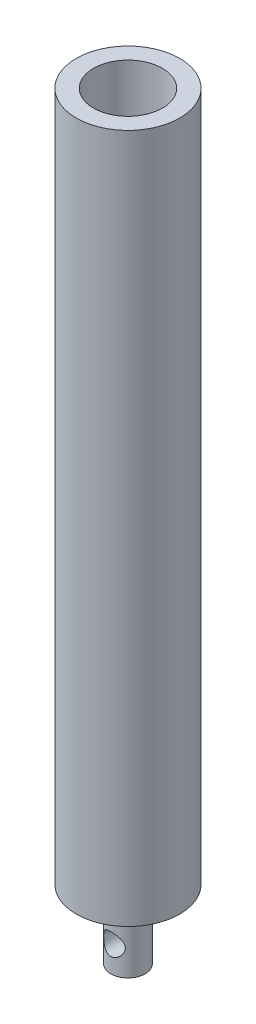
ISO-10303-21;
HEADER;
FILE_DESCRIPTION(('STEP AP214'),'2;1');
FILE_NAME('part.step','',(''),(''),'','','');
FILE_SCHEMA(('AUTOMOTIVE_DESIGN { 1 0 10303 214 1 1 1 1 }'));
ENDSEC;
DATA;
#1=APPLICATION_CONTEXT('core data for automotive mechanical design processes');
#2=APPLICATION_PROTOCOL_DEFINITION('international standard','automotive_design',2000,#1);
#3=PRODUCT_CONTEXT('',#1,'mechanical');
#4=PRODUCT('Part','Part','',(#3));
#5=PRODUCT_RELATED_PRODUCT_CATEGORY('part','',(#4));
#6=PRODUCT_DEFINITION_FORMATION('','',#4);
#7=PRODUCT_DEFINITION_CONTEXT('part definition',#1,'design');
#8=PRODUCT_DEFINITION('design','',#6,#7);
#9=PRODUCT_DEFINITION_SHAPE('','',#8);
#10=(LENGTH_UNIT() NAMED_UNIT(*) SI_UNIT(.MILLI.,.METRE.));
#11=(NAMED_UNIT(*) PLANE_ANGLE_UNIT() SI_UNIT($,.RADIAN.));
#12=(NAMED_UNIT(*) SI_UNIT($,.STERADIAN.) SOLID_ANGLE_UNIT());
#13=UNCERTAINTY_MEASURE_WITH_UNIT(LENGTH_MEASURE(1.E-05),#10,'distance_accuracy_value','');
#14=(GEOMETRIC_REPRESENTATION_CONTEXT(3) GLOBAL_UNCERTAINTY_ASSIGNED_CONTEXT((#13)) GLOBAL_UNIT_ASSIGNED_CONTEXT((#10,
#11,#12)) REPRESENTATION_CONTEXT('',''));
#15=CARTESIAN_POINT('',(0.,0.,0.));
#16=DIRECTION('',(0.,0.,1.));
#17=DIRECTION('',(1.,0.,0.));
#18=AXIS2_PLACEMENT_3D('',#15,#16,#17);
#19=CARTESIAN_POINT('',(0.,254.,0.));
#20=DIRECTION('',(0.,-1.,0.));
#21=DIRECTION('',(0.,0.,-1.));
#22=AXIS2_PLACEMENT_3D('',#19,#20,#21);
#23=CYLINDRICAL_SURFACE('',#22,19.05);
#24=CARTESIAN_POINT('',(0.,254.,0.));
#25=DIRECTION('',(0.,1.,0.));
#26=DIRECTION('',(0.,0.,1.));
#27=AXIS2_PLACEMENT_3D('',#24,#25,#26);
#28=CIRCLE('',#27,19.05);
#29=CARTESIAN_POINT('',(0.,254.,19.05));
#30=VERTEX_POINT('',#29);
#31=EDGE_CURVE('E10',#30,#30,#28,.T.);
#32=ORIENTED_EDGE('',*,*,#31,.F.);
#33=EDGE_LOOP('',(#32));
#34=FACE_BOUND('',#33,.T.);
#35=CARTESIAN_POINT('',(0.,0.,0.));
#36=DIRECTION('',(0.,1.,0.));
#37=DIRECTION('',(0.,0.,1.));
#38=AXIS2_PLACEMENT_3D('',#35,#36,#37);
#39=CIRCLE('',#38,19.05);
#40=CARTESIAN_POINT('',(0.,0.,19.05));
#41=VERTEX_POINT('',#40);
#42=EDGE_CURVE('E55',#41,#41,#39,.T.);
#43=ORIENTED_EDGE('',*,*,#42,.T.);
#44=EDGE_LOOP('',(#43));
#45=FACE_BOUND('',#44,.T.);
#46=ADVANCED_FACE('F42',(#34,#45),#23,.T.);
#47=CARTESIAN_POINT('',(0.,254.,0.));
#48=DIRECTION('',(0.,1.,0.));
#49=DIRECTION('',(0.,0.,1.));
#50=AXIS2_PLACEMENT_3D('',#47,#48,#49);
#51=PLANE('',#50);
#52=CARTESIAN_POINT('',(0.,254.,0.));
#53=DIRECTION('',(0.,1.,0.));
#54=DIRECTION('',(0.,0.,1.));
#55=AXIS2_PLACEMENT_3D('',#52,#53,#54);
#56=CIRCLE('',#55,12.7);
#57=CARTESIAN_POINT('',(0.,254.,12.7));
#58=VERTEX_POINT('',#57);
#59=EDGE_CURVE('E123',#58,#58,#56,.T.);
#60=ORIENTED_EDGE('',*,*,#59,.F.);
#61=EDGE_LOOP('',(#60));
#62=FACE_BOUND('',#61,.T.);
#63=ORIENTED_EDGE('',*,*,#31,.T.);
#64=EDGE_LOOP('',(#63));
#65=FACE_BOUND('',#64,.T.);
#66=ADVANCED_FACE('F100',(#62,#65),#51,.T.);
#67=CARTESIAN_POINT('',(0.,0.,0.));
#68=DIRECTION('',(0.,1.,0.));
#69=DIRECTION('',(0.,0.,1.));
#70=AXIS2_PLACEMENT_3D('',#67,#68,#69);
#71=PLANE('',#70);
#72=CARTESIAN_POINT('',(0.,0.,0.));
#73=DIRECTION('',(0.,1.,0.));
#74=DIRECTION('',(0.,0.,1.));
#75=AXIS2_PLACEMENT_3D('',#72,#73,#74);
#76=CIRCLE('',#75,6.35);
#77=CARTESIAN_POINT('',(0.,0.,6.35));
#78=VERTEX_POINT('',#77);
#79=EDGE_CURVE('E66',#78,#78,#76,.T.);
#80=ORIENTED_EDGE('',*,*,#79,.T.);
#81=EDGE_LOOP('',(#80));
#82=FACE_BOUND('',#81,.T.);
#83=ORIENTED_EDGE('',*,*,#42,.F.);
#84=EDGE_LOOP('',(#83));
#85=FACE_BOUND('',#84,.T.);
#86=ADVANCED_FACE('F96',(#82,#85),#71,.F.);
#87=CARTESIAN_POINT('',(0.,-25.4,0.));
#88=DIRECTION('',(0.,1.,0.));
#89=DIRECTION('',(0.,0.,1.));
#90=AXIS2_PLACEMENT_3D('',#87,#88,#89);
#91=CYLINDRICAL_SURFACE('',#90,6.35);
#92=CARTESIAN_POINT('',(0.,-19.84375,6.35));
#93=CARTESIAN_POINT('',(0.100869629316745,-19.8437497148845,6.34999972380215));
#94=CARTESIAN_POINT('',(0.201744626074195,-19.8398991259642,6.34759101835538));
#95=CARTESIAN_POINT('',(0.402721127100786,-19.8245514176762,6.33801583186877));
#96=CARTESIAN_POINT('',(0.502822276129513,-19.8130509756089,6.33084728340221));
#97=CARTESIAN_POINT('',(0.70158051846555,-19.7825414287455,6.31191404239796));
#98=CARTESIAN_POINT('',(0.800235376664192,-19.76352175969,6.30014288360457));
#99=CARTESIAN_POINT('',(0.995261867522272,-19.7182371547667,6.27229481424512));
#100=CARTESIAN_POINT('',(1.09163251289094,-19.6919691458434,6.25621607749337));
#101=CARTESIAN_POINT('',(1.37531323501,-19.6030735324116,6.20224188249421));
#102=CARTESIAN_POINT('',(1.55840926440142,-19.5301625346495,6.1584857231408));
#103=CARTESIAN_POINT('',(1.90903240198785,-19.3599183134083,6.05899553384335));
#104=CARTESIAN_POINT('',(2.07656123238679,-19.2625877958866,6.00326283113316));
#105=CARTESIAN_POINT('',(2.4065588491651,-19.0376621114467,5.87915324427494));
#106=CARTESIAN_POINT('',(2.56755512551414,-18.9082707560059,5.8101220401549));
#107=CARTESIAN_POINT('',(2.86698422438002,-18.6270285867914,5.66837011991012));
#108=CARTESIAN_POINT('',(3.00538619435875,-18.4751475939121,5.59564453375765));
#109=CARTESIAN_POINT('',(3.27478542598937,-18.1291425577706,5.44291586951386));
#110=CARTESIAN_POINT('',(3.40224107925978,-17.9320832229209,5.3632611695848));
#111=CARTESIAN_POINT('',(3.62184863294152,-17.5146816656333,5.21748377007815));
#112=CARTESIAN_POINT('',(3.71406015098582,-17.2943795727239,5.15133830786319));
#113=CARTESIAN_POINT('',(3.83963543162425,-16.8947765942964,5.05807902988526));
#114=CARTESIAN_POINT('',(3.88205827525502,-16.7196553516661,5.02529176687093));
#115=CARTESIAN_POINT('',(3.94277354635795,-16.3629786856596,4.97780809341062));
#116=CARTESIAN_POINT('',(3.96110005202576,-16.1814327226487,4.96308613611561));
#117=CARTESIAN_POINT('',(3.97252564110268,-15.8165386666315,4.95394887663679));
#118=CARTESIAN_POINT('',(3.96555856807907,-15.6331871004409,4.95958682645353));
#119=CARTESIAN_POINT('',(3.92672310654853,-15.2707654436831,4.99038251522961));
#120=CARTESIAN_POINT('',(3.89483475950964,-15.0916989033503,5.01555589928648));
#121=CARTESIAN_POINT('',(3.80898713732996,-14.7464828345544,5.08103423455141));
#122=CARTESIAN_POINT('',(3.7555487476477,-14.5801316641176,5.12098034459293));
#123=CARTESIAN_POINT('',(3.62871406027261,-14.2584135344714,5.2116215917764));
#124=CARTESIAN_POINT('',(3.55531070375237,-14.1030504847559,5.2623205292966));
#125=CARTESIAN_POINT('',(3.37486048916105,-13.7768530768272,5.38019103425625));
#126=CARTESIAN_POINT('',(3.2640903372882,-13.6085502415772,5.44867057137878));
#127=CARTESIAN_POINT('',(3.01905823407116,-13.2910940553607,5.58817880570407));
#128=CARTESIAN_POINT('',(2.88477213816952,-13.1419606618269,5.65921006267352));
#129=CARTESIAN_POINT('',(2.57018313723309,-12.8418942342447,5.80962278665086));
#130=CARTESIAN_POINT('',(2.38594341218007,-12.694724011811,5.88844834102744));
#131=CARTESIAN_POINT('',(2.08985060651593,-12.4989749899201,5.99717967914442));
#132=CARTESIAN_POINT('',(1.98780760307316,-12.4378684994638,6.03185406678169));
#133=CARTESIAN_POINT('',(1.77764139567506,-12.3246212060409,6.0970945223667));
#134=CARTESIAN_POINT('',(1.66952199855952,-12.2724748708595,6.12766312276188));
#135=CARTESIAN_POINT('',(1.45381852611206,-12.1803550482438,6.18228328066744));
#136=CARTESIAN_POINT('',(1.34651469383125,-12.1398799173968,6.2065958335956));
#137=CARTESIAN_POINT('',(1.12789875245987,-12.0681585103299,6.25002000335207));
#138=CARTESIAN_POINT('',(1.0165890003298,-12.0369069037374,6.26913462361663));
#139=CARTESIAN_POINT('',(0.790959442371594,-11.9841426572887,6.30157612152695));
#140=CARTESIAN_POINT('',(0.676642432633434,-11.9626212870843,6.31490818706803));
#141=CARTESIAN_POINT('',(0.446020383866622,-11.9296732938582,6.33537355695884));
#142=CARTESIAN_POINT('',(0.329715687898611,-11.918244946434,6.34250792018845));
#143=CARTESIAN_POINT('',(0.11371352085188,-11.9066319109454,6.34976016207931));
#144=CARTESIAN_POINT('',(0.0141188560347457,-11.9050277259702,6.35076380441156));
#145=CARTESIAN_POINT('',(-0.184879721587425,-11.9093092911955,6.34808814081896));
#146=CARTESIAN_POINT('',(-0.284283566807632,-11.9151973301643,6.3444074038825));
#147=CARTESIAN_POINT('',(-0.482049788768369,-11.9343824630312,6.33245077139595));
#148=CARTESIAN_POINT('',(-0.580412622595363,-11.947676154972,6.3241769857746));
#149=CARTESIAN_POINT('',(-0.775428568607449,-11.981479841522,6.30324138384447));
#150=CARTESIAN_POINT('',(-0.872081007457278,-12.001992614506,6.29057787811232));
#151=CARTESIAN_POINT('',(-1.15088548876523,-12.0720944246193,6.2475795865219));
#152=CARTESIAN_POINT('',(-1.32992793932614,-12.1310751219652,6.21170333539774));
#153=CARTESIAN_POINT('',(-1.67528351503095,-12.2723195124059,6.12761204900109));
#154=CARTESIAN_POINT('',(-1.84159450268555,-12.3545871043006,6.07939494769579));
#155=CARTESIAN_POINT('',(-2.17513202437409,-12.5492347075568,5.96868317626299));
#156=CARTESIAN_POINT('',(-2.3407564692919,-12.6638160437951,5.90523860940441));
#157=CARTESIAN_POINT('',(-2.65158053926593,-12.9152458107188,5.77237122101155));
#158=CARTESIAN_POINT('',(-2.79675713625212,-13.0521189780887,5.70294179898969));
#159=CARTESIAN_POINT('',(-3.08442971309266,-13.3671786559964,5.55326138829567));
#160=CARTESIAN_POINT('',(-3.22347731908553,-13.548478104909,5.47290255489714));
#161=CARTESIAN_POINT('',(-3.46965140221236,-13.9346806422575,5.3202447107867));
#162=CARTESIAN_POINT('',(-3.57679997868867,-14.139567252636,5.24794014199256));
#163=CARTESIAN_POINT('',(-3.73649146821152,-14.5246475651997,5.13503958826746));
#164=CARTESIAN_POINT('',(-3.79577268273818,-14.7010143817285,5.09097394791043));
#165=CARTESIAN_POINT('',(-3.88937844621214,-15.063448239194,5.0198347220599));
#166=CARTESIAN_POINT('',(-3.92374199348951,-15.2494996315799,4.99273459318101));
#167=CARTESIAN_POINT('',(-3.96561893072445,-15.6276366274951,4.95955081816446));
#168=CARTESIAN_POINT('',(-3.97297869579013,-15.8197505039366,4.95358742571596));
#169=CARTESIAN_POINT('',(-3.95985296455014,-16.2024408041522,4.96408275619006));
#170=CARTESIAN_POINT('',(-3.93935821277103,-16.3930166957165,4.98054893199321));
#171=CARTESIAN_POINT('',(-3.87471518477694,-16.751394582422,5.03095858468029));
#172=CARTESIAN_POINT('',(-3.83260357399809,-16.9197949714346,5.06338862387179));
#173=CARTESIAN_POINT('',(-3.7280094149118,-17.247028875334,5.14088162029399));
#174=CARTESIAN_POINT('',(-3.66551837191228,-17.4058583680505,5.18594984435844));
#175=CARTESIAN_POINT('',(-3.51163597607083,-17.7342694023257,5.29157878767792));
#176=CARTESIAN_POINT('',(-3.41737041979665,-17.9020786648252,5.35343780308803));
#177=CARTESIAN_POINT('',(-3.20674833077802,-18.2211303496818,5.48220019424994));
#178=CARTESIAN_POINT('',(-3.09037393827033,-18.3723592213684,5.54910762164007));
#179=CARTESIAN_POINT('',(-2.81201288386465,-18.6849156149845,5.69600834809494));
#180=CARTESIAN_POINT('',(-2.64555740186451,-18.8423069993518,5.77596775379648));
#181=CARTESIAN_POINT('',(-2.28539575501071,-19.1277900309385,5.92769410201569));
#182=CARTESIAN_POINT('',(-2.09167283421128,-19.2558635341499,5.99945595761419));
#183=CARTESIAN_POINT('',(-1.78349840023066,-19.4223694923273,6.09535255501647));
#184=CARTESIAN_POINT('',(-1.67766361859262,-19.4736638127035,6.12539791198672));
#185=CARTESIAN_POINT('',(-1.46081667034857,-19.5670047267177,6.18069576198291));
#186=CARTESIAN_POINT('',(-1.3498075395617,-19.6090566621584,6.20595102236847));
#187=CARTESIAN_POINT('',(-1.12374968935667,-19.6831857738524,6.25083486710867));
#188=CARTESIAN_POINT('',(-1.00871279453017,-19.7152898031161,6.27047858763776));
#189=CARTESIAN_POINT('',(-0.775424693974975,-19.7690983236554,6.30357618597448));
#190=CARTESIAN_POINT('',(-0.657175927267373,-19.790810485169,6.31703462884307));
#191=CARTESIAN_POINT('',(-0.449030670968344,-19.8192878659657,6.33473309529463));
#192=CARTESIAN_POINT('',(-0.359578266529576,-19.8284508701369,6.34044755472161));
#193=CARTESIAN_POINT('',(-0.180085357844225,-19.8406822530264,6.34808124780582));
#194=CARTESIAN_POINT('',(-0.0900448175432496,-19.8437502545183,6.35000024655771));
#195=CARTESIAN_POINT('',(0.,-19.84375,6.35));
#196=B_SPLINE_CURVE_WITH_KNOTS('',3,(#92,#93,#94,#95,#96,#97,#98,#99,#100,#101,#102,#103,#104,
#105,#106,#107,#108,#109,#110,#111,#112,#113,#114,#115,#116,#117,#118,#119,#120,#121,#122,#123,
#124,#125,#126,#127,#128,#129,#130,#131,#132,#133,#134,#135,#136,#137,#138,#139,#140,#141,#142,
#143,#144,#145,#146,#147,#148,#149,#150,#151,#152,#153,#154,#155,#156,#157,#158,#159,#160,#161,
#162,#163,#164,#165,#166,#167,#168,#169,#170,#171,#172,#173,#174,#175,#176,#177,#178,#179,#180,
#181,#182,#183,#184,#185,#186,#187,#188,#189,#190,#191,#192,#193,#194,#195),.UNSPECIFIED.,.T.,
.F.,(4,2,2,2,2,2,2,2,2,2,2,2,2,2,2,2,2,2,2,2,2,2,2,2,2,2,2,2,2,2,2,2,2,2,2,2,2,2,2,2,2,2,2,2,2,
2,2,2,2,2,2,4),(0.,0.302516233516313,0.605163950281538,0.908238396646872,1.21144153446557,
1.81418065622226,2.41685301718088,3.0676544095602,3.71933716994873,4.45928195393961,
5.19796947688029,5.74512625253872,6.29150837756736,6.83932061669391,7.38757202864409,
7.92329787351778,8.45921337676083,9.09524151943532,9.73192656244117,10.473659207889,
10.8449007236979,11.2159121959634,11.5670941342049,11.9180727214837,12.2687357690592,
12.6193388939245,12.9177954973323,13.2163432968997,13.5147540646189,13.8132798061551,
14.3863282790239,14.959472751134,15.5904700941052,16.2221724704342,16.9455752665781,
17.6684757236571,18.2398396151684,18.8103073306439,19.3840154566203,19.9579142604226,
20.4856196272713,21.0135452375688,21.6178993667911,22.2227437919992,22.9474311247318,
23.6725657407344,24.0362656723034,24.3997548409226,24.7622540963255,25.1244853768117,
25.3945204059581,25.664572147353),.UNSPECIFIED.);
#197=CARTESIAN_POINT('',(0.,-19.84375,6.35));
#198=VERTEX_POINT('',#197);
#199=EDGE_CURVE('E45',#198,#198,#196,.T.);
#200=ORIENTED_EDGE('',*,*,#199,.F.);
#201=EDGE_LOOP('',(#200));
#202=FACE_BOUND('',#201,.T.);
#203=CARTESIAN_POINT('',(3.96875,-15.875,-4.95696716122873));
#204=CARTESIAN_POINT('',(3.96874900573419,-15.9736710602069,-4.95696874271391));
#205=CARTESIAN_POINT('',(3.96506285378441,-16.0723611050935,-4.95992621673895));
#206=CARTESIAN_POINT('',(3.95038568680392,-16.2688923615109,-4.97162322998738));
#207=CARTESIAN_POINT('',(3.93939036932624,-16.3667330386874,-4.98036617474047));
#208=CARTESIAN_POINT('',(3.91026400431771,-16.5609054847003,-5.00326674172933));
#209=CARTESIAN_POINT('',(3.89211856248577,-16.6572337996005,-5.0174352848972));
#210=CARTESIAN_POINT('',(3.84898958559458,-16.8475171526472,-5.05059553757727));
#211=CARTESIAN_POINT('',(3.82400263212465,-16.9414709786609,-5.06958965788086));
#212=CARTESIAN_POINT('',(3.73979784747683,-17.2172176385898,-5.13237726434778));
#213=CARTESIAN_POINT('',(3.67103875807196,-17.3948102631118,-5.18222582698263));
#214=CARTESIAN_POINT('',(3.51065055159705,-17.7356105560387,-5.29218769633264));
#215=CARTESIAN_POINT('',(3.41902081068752,-17.8988178318921,-5.35230128303126));
#216=CARTESIAN_POINT('',(3.20116953144064,-18.2304066215122,-5.48574914610402));
#217=CARTESIAN_POINT('',(3.07195643927916,-18.3965449387693,-5.55977514499705));
#218=CARTESIAN_POINT('',(2.78860064257225,-18.7067509533842,-5.70716191438484));
#219=CARTESIAN_POINT('',(2.63443645462852,-18.8507994209,-5.7805220535563));
#220=CARTESIAN_POINT('',(2.37613926731809,-19.056037470055,-5.88953746389587));
#221=CARTESIAN_POINT('',(2.2797522354883,-19.1258414578107,-5.92760745108176));
#222=CARTESIAN_POINT('',(2.08024937759741,-19.2569778668479,-6.00052676804366));
#223=CARTESIAN_POINT('',(1.97713640155103,-19.318313842421,-6.03537744701976));
#224=CARTESIAN_POINT('',(1.76477431294211,-19.4318297607427,-6.10085360734356));
#225=CARTESIAN_POINT('',(1.65552823858491,-19.4840141850511,-6.13148115519993));
#226=CARTESIAN_POINT('',(1.43159316429791,-19.578549503353,-6.18759679112286));
#227=CARTESIAN_POINT('',(1.31690515876955,-19.6209021856253,-6.2130858137159));
#228=CARTESIAN_POINT('',(1.09492280953989,-19.6913161965639,-6.25580472432561));
#229=CARTESIAN_POINT('',(0.988060807618212,-19.720392218557,-6.27361056339239));
#230=CARTESIAN_POINT('',(0.771565275150484,-19.7696092220453,-6.30389777693923));
#231=CARTESIAN_POINT('',(0.661932208064743,-19.7897516873609,-6.31638003562699));
#232=CARTESIAN_POINT('',(0.440955340620525,-19.8207537239981,-6.33564111080196));
#233=CARTESIAN_POINT('',(0.329613026614533,-19.8316209418487,-6.34242462527042));
#234=CARTESIAN_POINT('',(0.106212272680804,-19.8439050696517,-6.35009507371279));
#235=CARTESIAN_POINT('',(-0.00584608333256189,-19.8453230673588,-6.35098268639825));
#236=CARTESIAN_POINT('',(-0.214504374891968,-19.8391320975868,-6.34711449983047));
#237=CARTESIAN_POINT('',(-0.311155327802995,-19.8327121795876,-6.34310204154902));
#238=CARTESIAN_POINT('',(-0.503464711140016,-19.8128752242534,-6.3307448174341));
#239=CARTESIAN_POINT('',(-0.599122835923828,-19.7994560937738,-6.32239875562129));
#240=CARTESIAN_POINT('',(-0.8835158809401,-19.7489312475588,-6.29111464724018));
#241=CARTESIAN_POINT('',(-1.06986326806675,-19.7015519001942,-6.26192655941664));
#242=CARTESIAN_POINT('',(-1.43160192720786,-19.5814806134875,-6.1892851361174));
#243=CARTESIAN_POINT('',(-1.60696380127574,-19.5087239128365,-6.14579531998115));
#244=CARTESIAN_POINT('',(-1.94315322662831,-19.3406123480059,-6.04791900743893));
#245=CARTESIAN_POINT('',(-2.10397745512777,-19.2452523354686,-5.99353002896703));
#246=CARTESIAN_POINT('',(-2.42796788941351,-19.0213353699321,-5.87035983359767));
#247=CARTESIAN_POINT('',(-2.5889348616174,-18.8901240051711,-5.8006298711353));
#248=CARTESIAN_POINT('',(-2.88797487368485,-18.6050797484186,-5.65770595500896));
#249=CARTESIAN_POINT('',(-3.02601401187134,-18.4512139817055,-5.58450707393901));
#250=CARTESIAN_POINT('',(-3.29360062054489,-18.1016096295464,-5.43151828233587));
#251=CARTESIAN_POINT('',(-3.4196850967378,-17.9030268613829,-5.35211595968415));
#252=CARTESIAN_POINT('',(-3.63620530690335,-17.4826735750668,-5.20744891427342));
#253=CARTESIAN_POINT('',(-3.72670670786939,-17.2609467347744,-5.14215825033774));
#254=CARTESIAN_POINT('',(-3.84868950645596,-16.8599821444911,-5.05116708155986));
#255=CARTESIAN_POINT('',(-3.88943347435477,-16.6849076918597,-5.01957036252242));
#256=CARTESIAN_POINT('',(-3.94684785137588,-16.328659277485,-4.97456265847659));
#257=CARTESIAN_POINT('',(-3.9635511492972,-16.1474939964094,-4.9611268300272));
#258=CARTESIAN_POINT('',(-3.97187850645185,-15.7837864335601,-4.95446474235017));
#259=CARTESIAN_POINT('',(-3.96344509290585,-15.6012419495108,-4.96128479620856));
#260=CARTESIAN_POINT('',(-3.92194208058627,-15.2406966763945,-4.99414935063267));
#261=CARTESIAN_POINT('',(-3.88885207959911,-15.0626997764739,-5.02020977157));
#262=CARTESIAN_POINT('',(-3.80063156106316,-14.7186065535341,-5.08730446176149));
#263=CARTESIAN_POINT('',(-3.74587336086038,-14.5523624244694,-5.12808481393473));
#264=CARTESIAN_POINT('',(-3.61640339779164,-14.2310255000156,-5.2201943145731));
#265=CARTESIAN_POINT('',(-3.54168455291001,-14.0759366873578,-5.27152720557506));
#266=CARTESIAN_POINT('',(-3.35804827456008,-13.7499520488877,-5.39074435246793));
#267=CARTESIAN_POINT('',(-3.24532821601102,-13.5816683704813,-5.45991909480843));
#268=CARTESIAN_POINT('',(-2.99622649795443,-13.264567649456,-5.6005056213583));
#269=CARTESIAN_POINT('',(-2.85982028941315,-13.1157710873508,-5.67191966289017));
#270=CARTESIAN_POINT('',(-2.54116539897778,-12.8175055719776,-5.82242654300694));
#271=CARTESIAN_POINT('',(-2.35507330809824,-12.6717515834257,-5.9009154708021));
#272=CARTESIAN_POINT('',(-2.05629732144542,-12.4784230180641,-6.00878011994655));
#273=CARTESIAN_POINT('',(-1.95337856452997,-12.4181745395426,-6.04310422735716));
#274=CARTESIAN_POINT('',(-1.74151127276995,-12.3067492779841,-6.10752493875841));
#275=CARTESIAN_POINT('',(-1.63256657311219,-12.2555668101497,-6.13762418944913));
#276=CARTESIAN_POINT('',(-1.41596484367067,-12.1656943566171,-6.19106192892849));
#277=CARTESIAN_POINT('',(-1.30861254813102,-12.1264446622781,-6.21469493407565));
#278=CARTESIAN_POINT('',(-1.09003485121242,-12.0571561337075,-6.25673203585057));
#279=CARTESIAN_POINT('',(-0.978811733467161,-12.0271119678152,-6.27513915875111));
#280=CARTESIAN_POINT('',(-0.753494733972717,-11.97672636573,-6.30616102496652));
#281=CARTESIAN_POINT('',(-0.639403448243407,-11.9563764659687,-6.31878082054033));
#282=CARTESIAN_POINT('',(-0.409374956656543,-11.9257159272083,-6.33784052403798));
#283=CARTESIAN_POINT('',(-0.293438059389596,-11.915403627451,-6.34428145427557));
#284=CARTESIAN_POINT('',(-0.0781479325996238,-11.9057802934148,-6.35029285323319));
#285=CARTESIAN_POINT('',(0.0211214404538208,-11.9050675096965,-6.35073872013369));
#286=CARTESIAN_POINT('',(0.219379742648355,-11.9110768430608,-6.3469838780748));
#287=CARTESIAN_POINT('',(0.318368576926838,-11.917801229875,-6.34278175060543));
#288=CARTESIAN_POINT('',(0.515228595163444,-11.9385923693547,-6.32983107242293));
#289=CARTESIAN_POINT('',(0.613100251321336,-11.9526558929446,-6.32108452117412));
#290=CARTESIAN_POINT('',(0.807069875129157,-11.9879252378496,-6.29926083182129));
#291=CARTESIAN_POINT('',(0.903167143698222,-12.0091338134357,-6.28618202375389));
#292=CARTESIAN_POINT('',(1.18111938882745,-12.0813704661347,-6.24193052654393));
#293=CARTESIAN_POINT('',(1.35975783413935,-12.1418021974719,-6.20523279759309));
#294=CARTESIAN_POINT('',(1.70409986680027,-12.2858564916743,-6.11965162494569));
#295=CARTESIAN_POINT('',(1.86980126581787,-12.3694829671401,-6.07076612549846));
#296=CARTESIAN_POINT('',(2.20235034138367,-12.5671589178098,-5.95869246769898));
#297=CARTESIAN_POINT('',(2.36753184575987,-12.6834651996625,-5.89454643022083));
#298=CARTESIAN_POINT('',(2.67721529241243,-12.9383676415839,-5.76051798247477));
#299=CARTESIAN_POINT('',(2.8216935487031,-13.0769889528148,-5.69062914355594));
#300=CARTESIAN_POINT('',(3.10744694557892,-13.3956982093495,-5.54038824335725));
#301=CARTESIAN_POINT('',(3.24525860579624,-13.5788831136607,-5.45998005910693));
#302=CARTESIAN_POINT('',(3.48860381232705,-13.968855206071,-5.30780044192229));
#303=CARTESIAN_POINT('',(3.59415521064981,-14.1756292532194,-5.23602424565204));
#304=CARTESIAN_POINT('',(3.74965107255957,-14.5618774227209,-5.12539577935228));
#305=CARTESIAN_POINT('',(3.80671941361063,-14.7373563286204,-5.08277435476138));
#306=CARTESIAN_POINT('',(3.87383024583868,-15.0072378750259,-5.03157137984087));
#307=CARTESIAN_POINT('',(3.89310844988638,-15.0982140894708,-5.01663389594777));
#308=CARTESIAN_POINT('',(3.92529036450986,-15.2819150242269,-4.99149479913686));
#309=CARTESIAN_POINT('',(3.93819735521796,-15.374638819238,-4.9812907494384));
#310=CARTESIAN_POINT('',(3.95477232469409,-15.5353582748798,-4.96813355656885));
#311=CARTESIAN_POINT('',(3.96000843964951,-15.603098300357,-4.96395541707156));
#312=CARTESIAN_POINT('',(3.96699805810774,-15.7388891571641,-4.95837132540193));
#313=CARTESIAN_POINT('',(3.9687506858107,-15.8069400623444,-4.9569660703741));
#314=CARTESIAN_POINT('',(3.96875,-15.875,-4.95696716122873));
#315=B_SPLINE_CURVE_WITH_KNOTS('',3,(#203,#204,#205,#206,#207,#208,#209,#210,#211,#212,#213,
#214,#215,#216,#217,#218,#219,#220,#221,#222,#223,#224,#225,#226,#227,#228,#229,#230,#231,#232,
#233,#234,#235,#236,#237,#238,#239,#240,#241,#242,#243,#244,#245,#246,#247,#248,#249,#250,#251,
#252,#253,#254,#255,#256,#257,#258,#259,#260,#261,#262,#263,#264,#265,#266,#267,#268,#269,#270,
#271,#272,#273,#274,#275,#276,#277,#278,#279,#280,#281,#282,#283,#284,#285,#286,#287,#288,#289,
#290,#291,#292,#293,#294,#295,#296,#297,#298,#299,#300,#301,#302,#303,#304,#305,#306,#307,#308,
#309,#310,#311,#312,#313,#314),.UNSPECIFIED.,.T.,.F.,(4,2,2,2,2,2,2,2,2,2,2,2,2,2,2,2,2,2,2,2,2,
2,2,2,2,2,2,2,2,2,2,2,2,2,2,2,2,2,2,2,2,2,2,2,2,2,2,2,2,2,2,2,2,2,2,4),(0.,0.29593431392531,
0.592042980241266,0.888750829635211,1.18560720264541,1.7735343406487,2.36147751720907,
3.02829640855696,3.69569252911842,4.07010970882502,4.44436925292617,4.8184450053661,
5.19245266439819,5.52846904453002,5.86442959304822,6.20011290688647,6.53575757759561,
6.82623573236151,7.11680080571322,7.69735665161288,8.27940500966086,8.86158606850619,
9.51621768733323,10.171808806416,10.9130133154004,11.6528434707381,12.1980852804615,
12.7425804616945,13.2883215353565,13.8345146872956,14.3717041509116,14.9090844624991,
15.5487757511578,16.189134035937,16.9321316665134,17.3039854096408,17.6756051518581,
18.0252521528444,18.3746962606994,18.7238347250934,19.0729154134038,19.3703566292702,
19.6678886455433,19.9652898638265,20.2628058555983,20.8365523841837,21.4103957540035,
22.0438008902535,22.6779249982449,23.4034525179255,24.1285778191369,24.6942514618864,
24.9765210922841,25.2586452480485,25.4627193607113,25.666844774117),.UNSPECIFIED.);
#316=CARTESIAN_POINT('',(3.96875,-15.875,-4.95696716122873));
#317=VERTEX_POINT('',#316);
#318=EDGE_CURVE('E68',#317,#317,#315,.T.);
#319=ORIENTED_EDGE('',*,*,#318,.F.);
#320=EDGE_LOOP('',(#319));
#321=FACE_BOUND('',#320,.T.);
#322=CARTESIAN_POINT('',(0.,-25.4,0.));
#323=DIRECTION('',(0.,1.,0.));
#324=DIRECTION('',(0.,0.,1.));
#325=AXIS2_PLACEMENT_3D('',#322,#323,#324);
#326=CIRCLE('',#325,6.35);
#327=CARTESIAN_POINT('',(0.,-25.4,6.35));
#328=VERTEX_POINT('',#327);
#329=EDGE_CURVE('E63',#328,#328,#326,.T.);
#330=ORIENTED_EDGE('',*,*,#329,.T.);
#331=EDGE_LOOP('',(#330));
#332=FACE_BOUND('',#331,.T.);
#333=ORIENTED_EDGE('',*,*,#79,.F.);
#334=EDGE_LOOP('',(#333));
#335=FACE_BOUND('',#334,.T.);
#336=ADVANCED_FACE('F73',(#202,#321,#332,#335),#91,.T.);
#337=CARTESIAN_POINT('',(0.,-25.4,0.));
#338=DIRECTION('',(0.,1.,0.));
#339=DIRECTION('',(0.,0.,1.));
#340=AXIS2_PLACEMENT_3D('',#337,#338,#339);
#341=PLANE('',#340);
#342=ORIENTED_EDGE('',*,*,#329,.F.);
#343=EDGE_LOOP('',(#342));
#344=FACE_BOUND('',#343,.T.);
#345=ADVANCED_FACE('F89',(#344),#341,.F.);
#346=CARTESIAN_POINT('',(0.,50.8,0.));
#347=DIRECTION('',(0.,1.,0.));
#348=DIRECTION('',(0.,0.,1.));
#349=AXIS2_PLACEMENT_3D('',#346,#347,#348);
#350=CYLINDRICAL_SURFACE('',#349,12.7);
#351=CARTESIAN_POINT('',(0.,50.8,0.));
#352=DIRECTION('',(0.,1.,0.));
#353=DIRECTION('',(0.,0.,1.));
#354=AXIS2_PLACEMENT_3D('',#351,#352,#353);
#355=CIRCLE('',#354,12.7);
#356=CARTESIAN_POINT('',(0.,50.8,12.7));
#357=VERTEX_POINT('',#356);
#358=EDGE_CURVE('E117',#357,#357,#355,.T.);
#359=ORIENTED_EDGE('',*,*,#358,.F.);
#360=EDGE_LOOP('',(#359));
#361=FACE_BOUND('',#360,.T.);
#362=ORIENTED_EDGE('',*,*,#59,.T.);
#363=EDGE_LOOP('',(#362));
#364=FACE_BOUND('',#363,.T.);
#365=ADVANCED_FACE('F86',(#361,#364),#350,.F.);
#366=CARTESIAN_POINT('',(0.,50.8,0.));
#367=DIRECTION('',(0.,1.,0.));
#368=DIRECTION('',(0.,0.,1.));
#369=AXIS2_PLACEMENT_3D('',#366,#367,#368);
#370=PLANE('',#369);
#371=ORIENTED_EDGE('',*,*,#358,.T.);
#372=EDGE_LOOP('',(#371));
#373=FACE_BOUND('',#372,.T.);
#374=ADVANCED_FACE('F81',(#373),#370,.T.);
#375=CARTESIAN_POINT('',(0.,-15.875,-19.05));
#376=DIRECTION('',(0.,0.,1.));
#377=DIRECTION('',(1.,0.,0.));
#378=AXIS2_PLACEMENT_3D('',#375,#376,#377);
#379=CYLINDRICAL_SURFACE('',#378,3.96875);
#380=ORIENTED_EDGE('',*,*,#199,.T.);
#381=EDGE_LOOP('',(#380));
#382=FACE_BOUND('',#381,.T.);
#383=ORIENTED_EDGE('',*,*,#318,.T.);
#384=EDGE_LOOP('',(#383));
#385=FACE_BOUND('',#384,.T.);
#386=ADVANCED_FACE('F77',(#382,#385),#379,.F.);
#387=CLOSED_SHELL('',(#46,#66,#86,#336,#345,#365,#374,#386));
#388=MANIFOLD_SOLID_BREP('B2',#387);
#389=ADVANCED_BREP_SHAPE_REPRESENTATION('',(#18,#388),#14);
#390=SHAPE_DEFINITION_REPRESENTATION(#9,#389);
ENDSEC;
END-ISO-10303-21;
